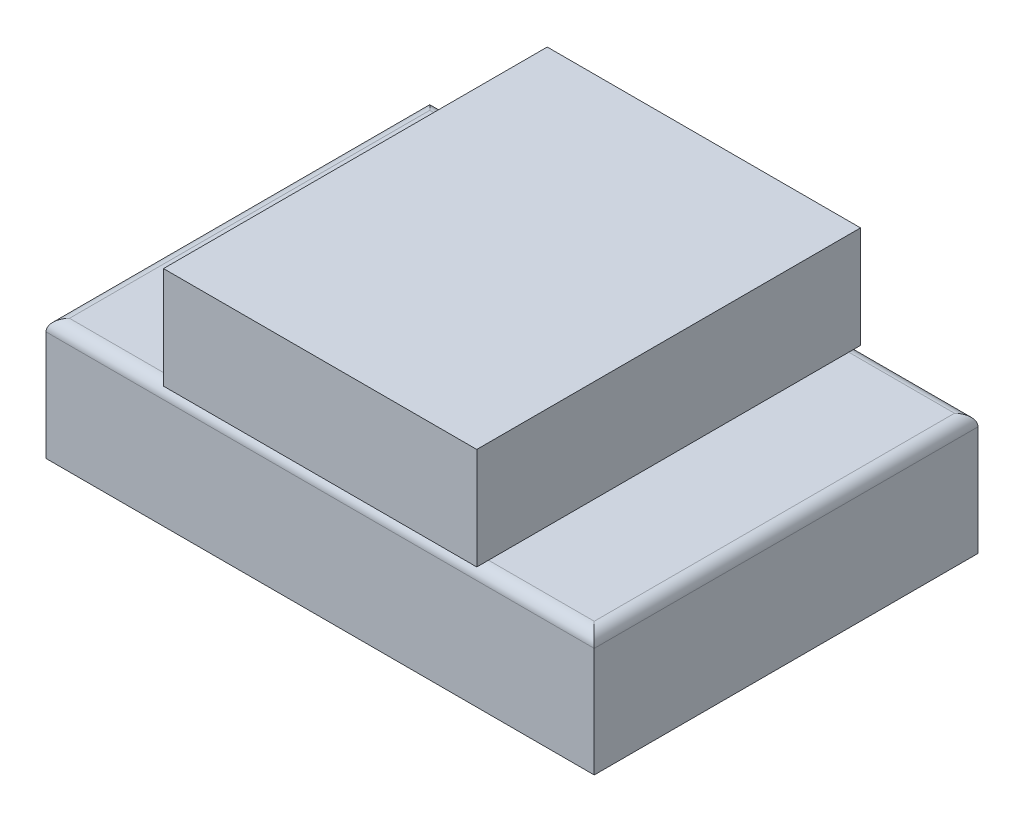
ISO-10303-21;
HEADER;
FILE_DESCRIPTION(('STEP AP214'),'2;1');
FILE_NAME('part.step','',(''),(''),'','','');
FILE_SCHEMA(('AUTOMOTIVE_DESIGN { 1 0 10303 214 1 1 1 1 }'));
ENDSEC;
DATA;
#1=APPLICATION_CONTEXT('core data for automotive mechanical design processes');
#2=APPLICATION_PROTOCOL_DEFINITION('international standard','automotive_design',2000,#1);
#3=PRODUCT_CONTEXT('',#1,'mechanical');
#4=PRODUCT('Part','Part','',(#3));
#5=PRODUCT_RELATED_PRODUCT_CATEGORY('part','',(#4));
#6=PRODUCT_DEFINITION_FORMATION('','',#4);
#7=PRODUCT_DEFINITION_CONTEXT('part definition',#1,'design');
#8=PRODUCT_DEFINITION('design','',#6,#7);
#9=PRODUCT_DEFINITION_SHAPE('','',#8);
#10=(LENGTH_UNIT() NAMED_UNIT(*) SI_UNIT(.MILLI.,.METRE.));
#11=(NAMED_UNIT(*) PLANE_ANGLE_UNIT() SI_UNIT($,.RADIAN.));
#12=(NAMED_UNIT(*) SI_UNIT($,.STERADIAN.) SOLID_ANGLE_UNIT());
#13=UNCERTAINTY_MEASURE_WITH_UNIT(LENGTH_MEASURE(1.E-05),#10,'distance_accuracy_value','');
#14=(GEOMETRIC_REPRESENTATION_CONTEXT(3) GLOBAL_UNCERTAINTY_ASSIGNED_CONTEXT((#13)) GLOBAL_UNIT_ASSIGNED_CONTEXT((#10,
#11,#12)) REPRESENTATION_CONTEXT('',''));
#15=CARTESIAN_POINT('',(0.,0.,0.));
#16=DIRECTION('',(0.,0.,1.));
#17=DIRECTION('',(1.,0.,0.));
#18=AXIS2_PLACEMENT_3D('',#15,#16,#17);
#19=CARTESIAN_POINT('',(35.,-15.5,-24.5));
#20=DIRECTION('',(-1.,0.,0.));
#21=DIRECTION('',(0.,0.,1.));
#22=AXIS2_PLACEMENT_3D('',#19,#20,#21);
#23=PLANE('',#22);
#24=DIRECTION('',(0.,1.,0.));
#25=VECTOR('',#24,1.);
#26=CARTESIAN_POINT('',(35.,-15.5,-24.5));
#27=LINE('',#26,#25);
#28=CARTESIAN_POINT('',(35.,-15.5,-24.5));
#29=VERTEX_POINT('',#28);
#30=CARTESIAN_POINT('',(35.,-1.5,-24.5));
#31=VERTEX_POINT('',#30);
#32=EDGE_CURVE('E244',#29,#31,#27,.T.);
#33=ORIENTED_EDGE('',*,*,#32,.T.);
#34=DIRECTION('',(0.,0.,1.));
#35=VECTOR('',#34,1.);
#36=CARTESIAN_POINT('',(35.,-1.5,-24.5));
#37=LINE('',#36,#35);
#38=CARTESIAN_POINT('',(35.,-1.5,24.5));
#39=VERTEX_POINT('',#38);
#40=EDGE_CURVE('E12',#31,#39,#37,.T.);
#41=ORIENTED_EDGE('',*,*,#40,.T.);
#42=DIRECTION('',(0.,1.,0.));
#43=VECTOR('',#42,1.);
#44=CARTESIAN_POINT('',(35.,-15.5,24.5));
#45=LINE('',#44,#43);
#46=CARTESIAN_POINT('',(35.,-15.5,24.5));
#47=VERTEX_POINT('',#46);
#48=EDGE_CURVE('E103',#47,#39,#45,.T.);
#49=ORIENTED_EDGE('',*,*,#48,.F.);
#50=DIRECTION('',(0.,0.,1.));
#51=VECTOR('',#50,1.);
#52=CARTESIAN_POINT('',(35.,-15.5,-24.5));
#53=LINE('',#52,#51);
#54=EDGE_CURVE('E111',#29,#47,#53,.T.);
#55=ORIENTED_EDGE('',*,*,#54,.F.);
#56=EDGE_LOOP('',(#33,#41,#49,#55));
#57=FACE_BOUND('',#56,.T.);
#58=ADVANCED_FACE('F47',(#57),#23,.F.);
#59=CARTESIAN_POINT('',(35.,-15.5,24.5));
#60=DIRECTION('',(0.,0.,-1.));
#61=DIRECTION('',(-1.,0.,0.));
#62=AXIS2_PLACEMENT_3D('',#59,#60,#61);
#63=PLANE('',#62);
#64=ORIENTED_EDGE('',*,*,#48,.T.);
#65=DIRECTION('',(-1.,0.,0.));
#66=VECTOR('',#65,1.);
#67=CARTESIAN_POINT('',(35.,-1.5,24.5));
#68=LINE('',#67,#66);
#69=CARTESIAN_POINT('',(-35.,-1.5,24.5));
#70=VERTEX_POINT('',#69);
#71=EDGE_CURVE('E136',#39,#70,#68,.T.);
#72=ORIENTED_EDGE('',*,*,#71,.T.);
#73=DIRECTION('',(0.,1.,0.));
#74=VECTOR('',#73,1.);
#75=CARTESIAN_POINT('',(-35.,-15.5,24.5));
#76=LINE('',#75,#74);
#77=CARTESIAN_POINT('',(-35.,-15.5,24.5));
#78=VERTEX_POINT('',#77);
#79=EDGE_CURVE('E106',#78,#70,#76,.T.);
#80=ORIENTED_EDGE('',*,*,#79,.F.);
#81=DIRECTION('',(-1.,0.,0.));
#82=VECTOR('',#81,1.);
#83=CARTESIAN_POINT('',(35.,-15.5,24.5));
#84=LINE('',#83,#82);
#85=EDGE_CURVE('E100',#47,#78,#84,.T.);
#86=ORIENTED_EDGE('',*,*,#85,.F.);
#87=EDGE_LOOP('',(#64,#72,#80,#86));
#88=FACE_BOUND('',#87,.T.);
#89=ADVANCED_FACE('F102',(#88),#63,.F.);
#90=CARTESIAN_POINT('',(-35.,-15.5,-24.5));
#91=DIRECTION('',(-1.,0.,0.));
#92=DIRECTION('',(0.,0.,1.));
#93=AXIS2_PLACEMENT_3D('',#90,#91,#92);
#94=PLANE('',#93);
#95=ORIENTED_EDGE('',*,*,#79,.T.);
#96=DIRECTION('',(0.,0.,1.));
#97=VECTOR('',#96,1.);
#98=CARTESIAN_POINT('',(-35.,-1.5,-24.5));
#99=LINE('',#98,#97);
#100=CARTESIAN_POINT('',(-35.,-1.5,-24.5));
#101=VERTEX_POINT('',#100);
#102=EDGE_CURVE('E133',#70,#101,#99,.F.);
#103=ORIENTED_EDGE('',*,*,#102,.T.);
#104=DIRECTION('',(0.,1.,0.));
#105=VECTOR('',#104,1.);
#106=CARTESIAN_POINT('',(-35.,-15.5,-24.5));
#107=LINE('',#106,#105);
#108=CARTESIAN_POINT('',(-35.,-15.5,-24.5));
#109=VERTEX_POINT('',#108);
#110=EDGE_CURVE('E123',#109,#101,#107,.T.);
#111=ORIENTED_EDGE('',*,*,#110,.F.);
#112=DIRECTION('',(0.,0.,1.));
#113=VECTOR('',#112,1.);
#114=CARTESIAN_POINT('',(-35.,-15.5,-24.5));
#115=LINE('',#114,#113);
#116=EDGE_CURVE('E110',#109,#78,#115,.T.);
#117=ORIENTED_EDGE('',*,*,#116,.T.);
#118=EDGE_LOOP('',(#95,#103,#111,#117));
#119=FACE_BOUND('',#118,.T.);
#120=ADVANCED_FACE('F159',(#119),#94,.T.);
#121=CARTESIAN_POINT('',(35.,-15.5,-24.5));
#122=DIRECTION('',(0.,0.,-1.));
#123=DIRECTION('',(-1.,0.,0.));
#124=AXIS2_PLACEMENT_3D('',#121,#122,#123);
#125=PLANE('',#124);
#126=ORIENTED_EDGE('',*,*,#110,.T.);
#127=DIRECTION('',(-1.,0.,0.));
#128=VECTOR('',#127,1.);
#129=CARTESIAN_POINT('',(35.,-1.5,-24.5));
#130=LINE('',#129,#128);
#131=EDGE_CURVE('E56',#101,#31,#130,.F.);
#132=ORIENTED_EDGE('',*,*,#131,.T.);
#133=ORIENTED_EDGE('',*,*,#32,.F.);
#134=DIRECTION('',(-1.,0.,0.));
#135=VECTOR('',#134,1.);
#136=CARTESIAN_POINT('',(35.,-15.5,-24.5));
#137=LINE('',#136,#135);
#138=EDGE_CURVE('E117',#29,#109,#137,.T.);
#139=ORIENTED_EDGE('',*,*,#138,.T.);
#140=EDGE_LOOP('',(#126,#132,#133,#139));
#141=FACE_BOUND('',#140,.T.);
#142=ADVANCED_FACE('F171',(#141),#125,.T.);
#143=CARTESIAN_POINT('',(0.,-15.5,0.));
#144=DIRECTION('',(0.,-1.,0.));
#145=DIRECTION('',(0.,0.,-1.));
#146=AXIS2_PLACEMENT_3D('',#143,#144,#145);
#147=PLANE('',#146);
#148=ORIENTED_EDGE('',*,*,#54,.T.);
#149=ORIENTED_EDGE('',*,*,#85,.T.);
#150=ORIENTED_EDGE('',*,*,#116,.F.);
#151=ORIENTED_EDGE('',*,*,#138,.F.);
#152=EDGE_LOOP('',(#148,#149,#150,#151));
#153=FACE_BOUND('',#152,.T.);
#154=ADVANCED_FACE('F115',(#153),#147,.T.);
#155=CARTESIAN_POINT('',(0.,0.,0.));
#156=DIRECTION('',(0.,-1.,0.));
#157=DIRECTION('',(0.,0.,-1.));
#158=AXIS2_PLACEMENT_3D('',#155,#156,#157);
#159=PLANE('',#158);
#160=DIRECTION('',(-1.,0.,0.));
#161=VECTOR('',#160,1.);
#162=CARTESIAN_POINT('',(-35.,0.,-23.));
#163=LINE('',#162,#161);
#164=CARTESIAN_POINT('',(33.5,0.,-23.));
#165=VERTEX_POINT('',#164);
#166=CARTESIAN_POINT('',(-33.5,0.,-23.));
#167=VERTEX_POINT('',#166);
#168=EDGE_CURVE('E121',#165,#167,#163,.T.);
#169=ORIENTED_EDGE('',*,*,#168,.T.);
#170=DIRECTION('',(0.,0.,1.));
#171=VECTOR('',#170,1.);
#172=CARTESIAN_POINT('',(-33.5,0.,24.5));
#173=LINE('',#172,#171);
#174=CARTESIAN_POINT('',(-33.5,0.,23.));
#175=VERTEX_POINT('',#174);
#176=EDGE_CURVE('E130',#167,#175,#173,.T.);
#177=ORIENTED_EDGE('',*,*,#176,.T.);
#178=DIRECTION('',(-1.,0.,0.));
#179=VECTOR('',#178,1.);
#180=CARTESIAN_POINT('',(0.,0.,23.));
#181=LINE('',#180,#179);
#182=CARTESIAN_POINT('',(33.5,0.,23.));
#183=VERTEX_POINT('',#182);
#184=EDGE_CURVE('E128',#175,#183,#181,.F.);
#185=ORIENTED_EDGE('',*,*,#184,.T.);
#186=DIRECTION('',(0.,0.,1.));
#187=VECTOR('',#186,1.);
#188=CARTESIAN_POINT('',(33.5,0.,0.));
#189=LINE('',#188,#187);
#190=EDGE_CURVE('E119',#183,#165,#189,.F.);
#191=ORIENTED_EDGE('',*,*,#190,.T.);
#192=EDGE_LOOP('',(#169,#177,#185,#191));
#193=FACE_BOUND('',#192,.T.);
#194=ADVANCED_FACE('F164',(#193),#159,.F.);
#195=CARTESIAN_POINT('',(33.5,-1.5,-24.5));
#196=DIRECTION('',(0.,0.,1.));
#197=DIRECTION('',(1.,0.,0.));
#198=AXIS2_PLACEMENT_3D('',#195,#196,#197);
#199=CYLINDRICAL_SURFACE('',#198,1.5);
#200=CARTESIAN_POINT('',(33.5,-1.5,23.));
#201=DIRECTION('',(-0.707106781186547,0.,0.707106781186548));
#202=DIRECTION('',(0.707106781186548,0.,0.707106781186547));
#203=AXIS2_PLACEMENT_3D('',#200,#201,#202);
#204=ELLIPSE('',#203,2.12132034355964,1.5);
#205=EDGE_CURVE('E142',#39,#183,#204,.T.);
#206=ORIENTED_EDGE('',*,*,#205,.F.);
#207=ORIENTED_EDGE('',*,*,#40,.F.);
#208=CARTESIAN_POINT('',(33.5,-1.5,-23.));
#209=DIRECTION('',(0.707106781186548,0.,0.707106781186547));
#210=DIRECTION('',(-0.707106781186547,0.,0.707106781186548));
#211=AXIS2_PLACEMENT_3D('',#208,#209,#210);
#212=ELLIPSE('',#211,2.12132034355964,1.5);
#213=EDGE_CURVE('E51',#165,#31,#212,.F.);
#214=ORIENTED_EDGE('',*,*,#213,.F.);
#215=ORIENTED_EDGE('',*,*,#190,.F.);
#216=EDGE_LOOP('',(#206,#207,#214,#215));
#217=FACE_BOUND('',#216,.T.);
#218=ADVANCED_FACE('F49',(#217),#199,.T.);
#219=CARTESIAN_POINT('',(0.,-1.5,-23.));
#220=DIRECTION('',(1.,0.,0.));
#221=DIRECTION('',(0.,0.,-1.));
#222=AXIS2_PLACEMENT_3D('',#219,#220,#221);
#223=CYLINDRICAL_SURFACE('',#222,1.5);
#224=ORIENTED_EDGE('',*,*,#213,.T.);
#225=ORIENTED_EDGE('',*,*,#131,.F.);
#226=CARTESIAN_POINT('',(-33.5,-1.5,-23.));
#227=DIRECTION('',(0.707106781186547,0.,-0.707106781186547));
#228=DIRECTION('',(0.707106781186547,0.,0.707106781186547));
#229=AXIS2_PLACEMENT_3D('',#226,#227,#228);
#230=ELLIPSE('',#229,2.12132034355964,1.5);
#231=EDGE_CURVE('E141',#167,#101,#230,.F.);
#232=ORIENTED_EDGE('',*,*,#231,.F.);
#233=ORIENTED_EDGE('',*,*,#168,.F.);
#234=EDGE_LOOP('',(#224,#225,#232,#233));
#235=FACE_BOUND('',#234,.T.);
#236=ADVANCED_FACE('F151',(#235),#223,.T.);
#237=CARTESIAN_POINT('',(35.,-1.5,23.));
#238=DIRECTION('',(-1.,0.,0.));
#239=DIRECTION('',(0.,0.,1.));
#240=AXIS2_PLACEMENT_3D('',#237,#238,#239);
#241=CYLINDRICAL_SURFACE('',#240,1.5);
#242=ORIENTED_EDGE('',*,*,#205,.T.);
#243=ORIENTED_EDGE('',*,*,#184,.F.);
#244=CARTESIAN_POINT('',(-33.5,-1.5,23.));
#245=DIRECTION('',(-0.707106781186547,0.,-0.707106781186547));
#246=DIRECTION('',(-0.707106781186547,0.,0.707106781186547));
#247=AXIS2_PLACEMENT_3D('',#244,#245,#246);
#248=ELLIPSE('',#247,2.12132034355964,1.5);
#249=EDGE_CURVE('E139',#70,#175,#248,.T.);
#250=ORIENTED_EDGE('',*,*,#249,.F.);
#251=ORIENTED_EDGE('',*,*,#71,.F.);
#252=EDGE_LOOP('',(#242,#243,#250,#251));
#253=FACE_BOUND('',#252,.T.);
#254=ADVANCED_FACE('F156',(#253),#241,.T.);
#255=CARTESIAN_POINT('',(-33.5,-1.5,0.));
#256=DIRECTION('',(0.,0.,-1.));
#257=DIRECTION('',(-1.,0.,0.));
#258=AXIS2_PLACEMENT_3D('',#255,#256,#257);
#259=CYLINDRICAL_SURFACE('',#258,1.5);
#260=ORIENTED_EDGE('',*,*,#231,.T.);
#261=ORIENTED_EDGE('',*,*,#102,.F.);
#262=ORIENTED_EDGE('',*,*,#249,.T.);
#263=ORIENTED_EDGE('',*,*,#176,.F.);
#264=EDGE_LOOP('',(#260,#261,#262,#263));
#265=FACE_BOUND('',#264,.T.);
#266=ADVANCED_FACE('F161',(#265),#259,.T.);
#267=CLOSED_SHELL('',(#58,#89,#120,#142,#154,#194,#218,#236,#254,#266));
#268=MANIFOLD_SOLID_BREP('B2',#267);
#269=CARTESIAN_POINT('',(20.,13.,24.5));
#270=DIRECTION('',(0.,0.,1.));
#271=DIRECTION('',(1.,0.,0.));
#272=AXIS2_PLACEMENT_3D('',#269,#270,#271);
#273=PLANE('',#272);
#274=DIRECTION('',(-1.,0.,0.));
#275=VECTOR('',#274,1.);
#276=CARTESIAN_POINT('',(20.,0.,24.5));
#277=LINE('',#276,#275);
#278=CARTESIAN_POINT('',(20.,0.,24.5));
#279=VERTEX_POINT('',#278);
#280=CARTESIAN_POINT('',(-20.,0.,24.5));
#281=VERTEX_POINT('',#280);
#282=EDGE_CURVE('E316',#279,#281,#277,.T.);
#283=ORIENTED_EDGE('',*,*,#282,.F.);
#284=DIRECTION('',(0.,-1.,0.));
#285=VECTOR('',#284,1.);
#286=CARTESIAN_POINT('',(20.,13.,24.5));
#287=LINE('',#286,#285);
#288=CARTESIAN_POINT('',(20.,13.,24.5));
#289=VERTEX_POINT('',#288);
#290=EDGE_CURVE('E45',#289,#279,#287,.T.);
#291=ORIENTED_EDGE('',*,*,#290,.F.);
#292=DIRECTION('',(-1.,0.,0.));
#293=VECTOR('',#292,1.);
#294=CARTESIAN_POINT('',(20.,13.,24.5));
#295=LINE('',#294,#293);
#296=CARTESIAN_POINT('',(-20.,13.,24.5));
#297=VERTEX_POINT('',#296);
#298=EDGE_CURVE('E311',#289,#297,#295,.T.);
#299=ORIENTED_EDGE('',*,*,#298,.T.);
#300=DIRECTION('',(0.,-1.,0.));
#301=VECTOR('',#300,1.);
#302=CARTESIAN_POINT('',(-20.,13.,24.5));
#303=LINE('',#302,#301);
#304=EDGE_CURVE('E254',#297,#281,#303,.T.);
#305=ORIENTED_EDGE('',*,*,#304,.T.);
#306=EDGE_LOOP('',(#283,#291,#299,#305));
#307=FACE_BOUND('',#306,.T.);
#308=ADVANCED_FACE('F251',(#307),#273,.T.);
#309=CARTESIAN_POINT('',(20.,13.,24.5));
#310=DIRECTION('',(-1.,0.,0.));
#311=DIRECTION('',(0.,0.,1.));
#312=AXIS2_PLACEMENT_3D('',#309,#310,#311);
#313=PLANE('',#312);
#314=DIRECTION('',(0.,0.,-1.));
#315=VECTOR('',#314,1.);
#316=CARTESIAN_POINT('',(20.,0.,24.5));
#317=LINE('',#316,#315);
#318=CARTESIAN_POINT('',(20.,0.,-24.5));
#319=VERTEX_POINT('',#318);
#320=EDGE_CURVE('E284',#279,#319,#317,.T.);
#321=ORIENTED_EDGE('',*,*,#320,.T.);
#322=DIRECTION('',(0.,-1.,0.));
#323=VECTOR('',#322,1.);
#324=CARTESIAN_POINT('',(20.,13.,-24.5));
#325=LINE('',#324,#323);
#326=CARTESIAN_POINT('',(20.,13.,-24.5));
#327=VERTEX_POINT('',#326);
#328=EDGE_CURVE('E260',#327,#319,#325,.T.);
#329=ORIENTED_EDGE('',*,*,#328,.F.);
#330=DIRECTION('',(0.,0.,-1.));
#331=VECTOR('',#330,1.);
#332=CARTESIAN_POINT('',(20.,13.,24.5));
#333=LINE('',#332,#331);
#334=EDGE_CURVE('E301',#289,#327,#333,.T.);
#335=ORIENTED_EDGE('',*,*,#334,.F.);
#336=ORIENTED_EDGE('',*,*,#290,.T.);
#337=EDGE_LOOP('',(#321,#329,#335,#336));
#338=FACE_BOUND('',#337,.T.);
#339=ADVANCED_FACE('F326',(#338),#313,.F.);
#340=CARTESIAN_POINT('',(20.,13.,-24.5));
#341=DIRECTION('',(0.,0.,1.));
#342=DIRECTION('',(1.,0.,0.));
#343=AXIS2_PLACEMENT_3D('',#340,#341,#342);
#344=PLANE('',#343);
#345=DIRECTION('',(-1.,0.,0.));
#346=VECTOR('',#345,1.);
#347=CARTESIAN_POINT('',(20.,0.,-24.5));
#348=LINE('',#347,#346);
#349=CARTESIAN_POINT('',(-20.,0.,-24.5));
#350=VERTEX_POINT('',#349);
#351=EDGE_CURVE('E308',#319,#350,#348,.T.);
#352=ORIENTED_EDGE('',*,*,#351,.T.);
#353=DIRECTION('',(0.,-1.,0.));
#354=VECTOR('',#353,1.);
#355=CARTESIAN_POINT('',(-20.,13.,-24.5));
#356=LINE('',#355,#354);
#357=CARTESIAN_POINT('',(-20.,13.,-24.5));
#358=VERTEX_POINT('',#357);
#359=EDGE_CURVE('E305',#358,#350,#356,.T.);
#360=ORIENTED_EDGE('',*,*,#359,.F.);
#361=DIRECTION('',(-1.,0.,0.));
#362=VECTOR('',#361,1.);
#363=CARTESIAN_POINT('',(20.,13.,-24.5));
#364=LINE('',#363,#362);
#365=EDGE_CURVE('E296',#327,#358,#364,.T.);
#366=ORIENTED_EDGE('',*,*,#365,.F.);
#367=ORIENTED_EDGE('',*,*,#328,.T.);
#368=EDGE_LOOP('',(#352,#360,#366,#367));
#369=FACE_BOUND('',#368,.T.);
#370=ADVANCED_FACE('F306',(#369),#344,.F.);
#371=CARTESIAN_POINT('',(-20.,13.,24.5));
#372=DIRECTION('',(-1.,0.,0.));
#373=DIRECTION('',(0.,0.,1.));
#374=AXIS2_PLACEMENT_3D('',#371,#372,#373);
#375=PLANE('',#374);
#376=DIRECTION('',(0.,0.,-1.));
#377=VECTOR('',#376,1.);
#378=CARTESIAN_POINT('',(-20.,0.,24.5));
#379=LINE('',#378,#377);
#380=EDGE_CURVE('E319',#281,#350,#379,.T.);
#381=ORIENTED_EDGE('',*,*,#380,.F.);
#382=ORIENTED_EDGE('',*,*,#304,.F.);
#383=DIRECTION('',(0.,0.,-1.));
#384=VECTOR('',#383,1.);
#385=CARTESIAN_POINT('',(-20.,13.,24.5));
#386=LINE('',#385,#384);
#387=EDGE_CURVE('E300',#297,#358,#386,.T.);
#388=ORIENTED_EDGE('',*,*,#387,.T.);
#389=ORIENTED_EDGE('',*,*,#359,.T.);
#390=EDGE_LOOP('',(#381,#382,#388,#389));
#391=FACE_BOUND('',#390,.T.);
#392=ADVANCED_FACE('F310',(#391),#375,.T.);
#393=CARTESIAN_POINT('',(0.,13.,0.));
#394=DIRECTION('',(0.,-1.,0.));
#395=DIRECTION('',(0.,0.,-1.));
#396=AXIS2_PLACEMENT_3D('',#393,#394,#395);
#397=PLANE('',#396);
#398=ORIENTED_EDGE('',*,*,#298,.F.);
#399=ORIENTED_EDGE('',*,*,#334,.T.);
#400=ORIENTED_EDGE('',*,*,#365,.T.);
#401=ORIENTED_EDGE('',*,*,#387,.F.);
#402=EDGE_LOOP('',(#398,#399,#400,#401));
#403=FACE_BOUND('',#402,.T.);
#404=ADVANCED_FACE('F299',(#403),#397,.F.);
#405=CARTESIAN_POINT('',(0.,0.,0.));
#406=DIRECTION('',(0.,-1.,0.));
#407=DIRECTION('',(0.,0.,-1.));
#408=AXIS2_PLACEMENT_3D('',#405,#406,#407);
#409=PLANE('',#408);
#410=ORIENTED_EDGE('',*,*,#282,.T.);
#411=ORIENTED_EDGE('',*,*,#380,.T.);
#412=ORIENTED_EDGE('',*,*,#351,.F.);
#413=ORIENTED_EDGE('',*,*,#320,.F.);
#414=EDGE_LOOP('',(#410,#411,#412,#413));
#415=FACE_BOUND('',#414,.T.);
#416=ADVANCED_FACE('F324',(#415),#409,.T.);
#417=CLOSED_SHELL('',(#308,#339,#370,#392,#404,#416));
#418=MANIFOLD_SOLID_BREP('B6',#417);
#419=ADVANCED_BREP_SHAPE_REPRESENTATION('',(#18,#268,#418),#14);
#420=SHAPE_DEFINITION_REPRESENTATION(#9,#419);
ENDSEC;
END-ISO-10303-21;
